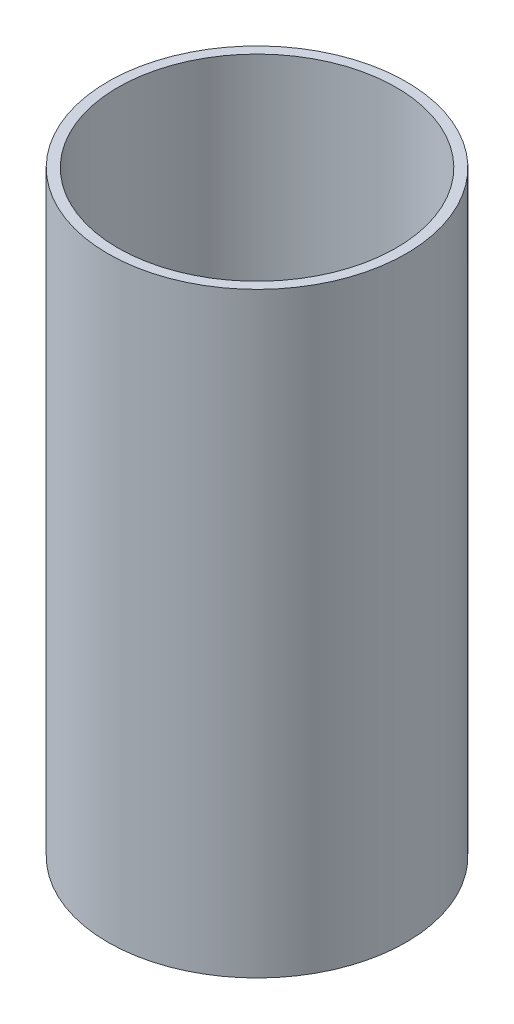
ISO-10303-21;
HEADER;
FILE_DESCRIPTION(('STEP AP214'),'2;1');
FILE_NAME('part.step','',(''),(''),'','','');
FILE_SCHEMA(('AUTOMOTIVE_DESIGN { 1 0 10303 214 1 1 1 1 }'));
ENDSEC;
DATA;
#1=APPLICATION_CONTEXT('core data for automotive mechanical design processes');
#2=APPLICATION_PROTOCOL_DEFINITION('international standard','automotive_design',2000,#1);
#3=PRODUCT_CONTEXT('',#1,'mechanical');
#4=PRODUCT('Part','Part','',(#3));
#5=PRODUCT_RELATED_PRODUCT_CATEGORY('part','',(#4));
#6=PRODUCT_DEFINITION_FORMATION('','',#4);
#7=PRODUCT_DEFINITION_CONTEXT('part definition',#1,'design');
#8=PRODUCT_DEFINITION('design','',#6,#7);
#9=PRODUCT_DEFINITION_SHAPE('','',#8);
#10=(LENGTH_UNIT() NAMED_UNIT(*) SI_UNIT(.MILLI.,.METRE.));
#11=(NAMED_UNIT(*) PLANE_ANGLE_UNIT() SI_UNIT($,.RADIAN.));
#12=(NAMED_UNIT(*) SI_UNIT($,.STERADIAN.) SOLID_ANGLE_UNIT());
#13=UNCERTAINTY_MEASURE_WITH_UNIT(LENGTH_MEASURE(1.E-05),#10,'distance_accuracy_value','');
#14=(GEOMETRIC_REPRESENTATION_CONTEXT(3) GLOBAL_UNCERTAINTY_ASSIGNED_CONTEXT((#13)) GLOBAL_UNIT_ASSIGNED_CONTEXT((#10,
#11,#12)) REPRESENTATION_CONTEXT('',''));
#15=CARTESIAN_POINT('',(0.,0.,0.));
#16=DIRECTION('',(0.,0.,1.));
#17=DIRECTION('',(1.,0.,0.));
#18=AXIS2_PLACEMENT_3D('',#15,#16,#17);
#19=CARTESIAN_POINT('',(0.,12.,0.));
#20=DIRECTION('',(0.,-1.,0.));
#21=DIRECTION('',(0.,0.,-1.));
#22=AXIS2_PLACEMENT_3D('',#19,#20,#21);
#23=CYLINDRICAL_SURFACE('',#22,3.);
#24=CARTESIAN_POINT('',(0.,12.,0.));
#25=DIRECTION('',(0.,1.,0.));
#26=DIRECTION('',(0.,0.,1.));
#27=AXIS2_PLACEMENT_3D('',#24,#25,#26);
#28=CIRCLE('',#27,3.);
#29=CARTESIAN_POINT('',(0.,12.,3.));
#30=VERTEX_POINT('',#29);
#31=EDGE_CURVE('E10',#30,#30,#28,.T.);
#32=ORIENTED_EDGE('',*,*,#31,.F.);
#33=EDGE_LOOP('',(#32));
#34=FACE_BOUND('',#33,.T.);
#35=CARTESIAN_POINT('',(0.,0.,0.));
#36=DIRECTION('',(0.,1.,0.));
#37=DIRECTION('',(0.,0.,1.));
#38=AXIS2_PLACEMENT_3D('',#35,#36,#37);
#39=CIRCLE('',#38,3.);
#40=CARTESIAN_POINT('',(0.,0.,3.));
#41=VERTEX_POINT('',#40);
#42=EDGE_CURVE('E38',#41,#41,#39,.T.);
#43=ORIENTED_EDGE('',*,*,#42,.T.);
#44=EDGE_LOOP('',(#43));
#45=FACE_BOUND('',#44,.T.);
#46=ADVANCED_FACE('F35',(#34,#45),#23,.T.);
#47=CARTESIAN_POINT('',(0.,12.,0.));
#48=DIRECTION('',(0.,1.,0.));
#49=DIRECTION('',(0.,0.,1.));
#50=AXIS2_PLACEMENT_3D('',#47,#48,#49);
#51=PLANE('',#50);
#52=CARTESIAN_POINT('',(0.,12.,0.));
#53=DIRECTION('',(0.,1.,0.));
#54=DIRECTION('',(0.,0.,1.));
#55=AXIS2_PLACEMENT_3D('',#52,#53,#54);
#56=CIRCLE('',#55,2.8);
#57=CARTESIAN_POINT('',(0.,12.,2.8));
#58=VERTEX_POINT('',#57);
#59=EDGE_CURVE('E49',#58,#58,#56,.T.);
#60=ORIENTED_EDGE('',*,*,#59,.F.);
#61=EDGE_LOOP('',(#60));
#62=FACE_BOUND('',#61,.T.);
#63=ORIENTED_EDGE('',*,*,#31,.T.);
#64=EDGE_LOOP('',(#63));
#65=FACE_BOUND('',#64,.T.);
#66=ADVANCED_FACE('F55',(#62,#65),#51,.T.);
#67=CARTESIAN_POINT('',(0.,0.,0.));
#68=DIRECTION('',(0.,1.,0.));
#69=DIRECTION('',(0.,0.,1.));
#70=AXIS2_PLACEMENT_3D('',#67,#68,#69);
#71=PLANE('',#70);
#72=CARTESIAN_POINT('',(0.,0.,0.));
#73=DIRECTION('',(0.,1.,0.));
#74=DIRECTION('',(0.,0.,1.));
#75=AXIS2_PLACEMENT_3D('',#72,#73,#74);
#76=CIRCLE('',#75,2.8);
#77=CARTESIAN_POINT('',(0.,0.,2.8));
#78=VERTEX_POINT('',#77);
#79=EDGE_CURVE('E45',#78,#78,#76,.F.);
#80=ORIENTED_EDGE('',*,*,#79,.F.);
#81=EDGE_LOOP('',(#80));
#82=FACE_BOUND('',#81,.T.);
#83=ORIENTED_EDGE('',*,*,#42,.F.);
#84=EDGE_LOOP('',(#83));
#85=FACE_BOUND('',#84,.T.);
#86=ADVANCED_FACE('F57',(#82,#85),#71,.F.);
#87=CARTESIAN_POINT('',(0.,-7.91959594928934,0.));
#88=DIRECTION('',(0.,1.,0.));
#89=DIRECTION('',(0.,0.,1.));
#90=AXIS2_PLACEMENT_3D('',#87,#88,#89);
#91=CYLINDRICAL_SURFACE('',#90,2.8);
#92=ORIENTED_EDGE('',*,*,#79,.T.);
#93=EDGE_LOOP('',(#92));
#94=FACE_BOUND('',#93,.T.);
#95=ORIENTED_EDGE('',*,*,#59,.T.);
#96=EDGE_LOOP('',(#95));
#97=FACE_BOUND('',#96,.T.);
#98=ADVANCED_FACE('F53',(#94,#97),#91,.F.);
#99=CLOSED_SHELL('',(#46,#66,#86,#98));
#100=MANIFOLD_SOLID_BREP('B2',#99);
#101=ADVANCED_BREP_SHAPE_REPRESENTATION('',(#18,#100),#14);
#102=SHAPE_DEFINITION_REPRESENTATION(#9,#101);
ENDSEC;
END-ISO-10303-21;
